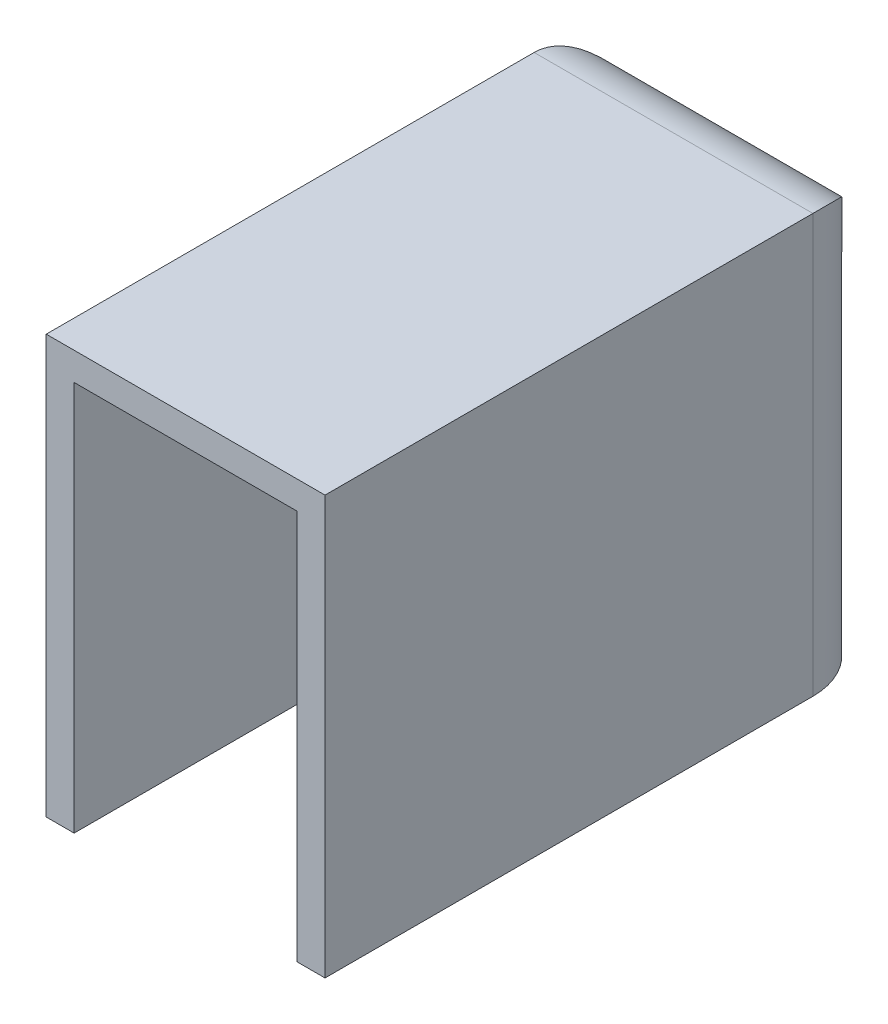
ISO-10303-21;
HEADER;
FILE_DESCRIPTION(('STEP AP214'),'2;1');
FILE_NAME('part.step','',(''),(''),'','','');
FILE_SCHEMA(('AUTOMOTIVE_DESIGN { 1 0 10303 214 1 1 1 1 }'));
ENDSEC;
DATA;
#1=APPLICATION_CONTEXT('core data for automotive mechanical design processes');
#2=APPLICATION_PROTOCOL_DEFINITION('international standard','automotive_design',2000,#1);
#3=PRODUCT_CONTEXT('',#1,'mechanical');
#4=PRODUCT('Part','Part','',(#3));
#5=PRODUCT_RELATED_PRODUCT_CATEGORY('part','',(#4));
#6=PRODUCT_DEFINITION_FORMATION('','',#4);
#7=PRODUCT_DEFINITION_CONTEXT('part definition',#1,'design');
#8=PRODUCT_DEFINITION('design','',#6,#7);
#9=PRODUCT_DEFINITION_SHAPE('','',#8);
#10=(LENGTH_UNIT() NAMED_UNIT(*) SI_UNIT(.MILLI.,.METRE.));
#11=(NAMED_UNIT(*) PLANE_ANGLE_UNIT() SI_UNIT($,.RADIAN.));
#12=(NAMED_UNIT(*) SI_UNIT($,.STERADIAN.) SOLID_ANGLE_UNIT());
#13=UNCERTAINTY_MEASURE_WITH_UNIT(LENGTH_MEASURE(1.E-05),#10,'distance_accuracy_value','');
#14=(GEOMETRIC_REPRESENTATION_CONTEXT(3) GLOBAL_UNCERTAINTY_ASSIGNED_CONTEXT((#13)) GLOBAL_UNIT_ASSIGNED_CONTEXT((#10,
#11,#12)) REPRESENTATION_CONTEXT('',''));
#15=CARTESIAN_POINT('',(0.,0.,0.));
#16=DIRECTION('',(0.,0.,1.));
#17=DIRECTION('',(1.,0.,0.));
#18=AXIS2_PLACEMENT_3D('',#15,#16,#17);
#19=CARTESIAN_POINT('',(0.,0.,2.));
#20=DIRECTION('',(0.,0.,-1.));
#21=DIRECTION('',(-1.,0.,0.));
#22=AXIS2_PLACEMENT_3D('',#19,#20,#21);
#23=PLANE('',#22);
#24=DIRECTION('',(0.,1.,0.));
#25=VECTOR('',#24,1.);
#26=CARTESIAN_POINT('',(8.,0.,2.));
#27=LINE('',#26,#25);
#28=CARTESIAN_POINT('',(8.,-15.,2.));
#29=VERTEX_POINT('',#28);
#30=CARTESIAN_POINT('',(8.,13.,2.));
#31=VERTEX_POINT('',#30);
#32=EDGE_CURVE('E177',#29,#31,#27,.T.);
#33=ORIENTED_EDGE('',*,*,#32,.T.);
#34=DIRECTION('',(-1.,0.,0.));
#35=VECTOR('',#34,1.);
#36=CARTESIAN_POINT('',(0.,13.,2.));
#37=LINE('',#36,#35);
#38=CARTESIAN_POINT('',(-8.,13.,2.));
#39=VERTEX_POINT('',#38);
#40=EDGE_CURVE('E181',#31,#39,#37,.T.);
#41=ORIENTED_EDGE('',*,*,#40,.T.);
#42=DIRECTION('',(0.,-1.,0.));
#43=VECTOR('',#42,1.);
#44=CARTESIAN_POINT('',(-8.,0.,2.));
#45=LINE('',#44,#43);
#46=CARTESIAN_POINT('',(-8.,-15.,2.));
#47=VERTEX_POINT('',#46);
#48=EDGE_CURVE('E190',#39,#47,#45,.T.);
#49=ORIENTED_EDGE('',*,*,#48,.T.);
#50=DIRECTION('',(1.,0.,0.));
#51=VECTOR('',#50,1.);
#52=CARTESIAN_POINT('',(0.,-15.,2.));
#53=LINE('',#52,#51);
#54=EDGE_CURVE('E197',#47,#29,#53,.T.);
#55=ORIENTED_EDGE('',*,*,#54,.T.);
#56=EDGE_LOOP('',(#33,#41,#49,#55));
#57=FACE_BOUND('',#56,.T.);
#58=DIRECTION('',(0.,-1.,0.));
#59=VECTOR('',#58,1.);
#60=CARTESIAN_POINT('',(-6.,-10.,2.));
#61=LINE('',#60,#59);
#62=CARTESIAN_POINT('',(-6.,-10.,2.));
#63=VERTEX_POINT('',#62);
#64=CARTESIAN_POINT('',(-6.,-12.,2.));
#65=VERTEX_POINT('',#64);
#66=EDGE_CURVE('E166',#63,#65,#61,.T.);
#67=ORIENTED_EDGE('',*,*,#66,.F.);
#68=DIRECTION('',(-1.,0.,0.));
#69=VECTOR('',#68,1.);
#70=CARTESIAN_POINT('',(6.,-10.,2.));
#71=LINE('',#70,#69);
#72=CARTESIAN_POINT('',(6.,-10.,2.));
#73=VERTEX_POINT('',#72);
#74=EDGE_CURVE('E163',#73,#63,#71,.T.);
#75=ORIENTED_EDGE('',*,*,#74,.F.);
#76=DIRECTION('',(0.,1.,0.));
#77=VECTOR('',#76,1.);
#78=CARTESIAN_POINT('',(6.,-10.,2.));
#79=LINE('',#78,#77);
#80=CARTESIAN_POINT('',(6.,-12.,2.));
#81=VERTEX_POINT('',#80);
#82=EDGE_CURVE('E64',#81,#73,#79,.T.);
#83=ORIENTED_EDGE('',*,*,#82,.F.);
#84=DIRECTION('',(1.,0.,0.));
#85=VECTOR('',#84,1.);
#86=CARTESIAN_POINT('',(6.,-12.,2.));
#87=LINE('',#86,#85);
#88=EDGE_CURVE('E59',#65,#81,#87,.T.);
#89=ORIENTED_EDGE('',*,*,#88,.F.);
#90=EDGE_LOOP('',(#67,#75,#83,#89));
#91=FACE_BOUND('',#90,.T.);
#92=ADVANCED_FACE('F41',(#57,#91),#23,.F.);
#93=CARTESIAN_POINT('',(0.,0.,40.));
#94=DIRECTION('',(0.,0.,-1.));
#95=DIRECTION('',(-1.,0.,0.));
#96=AXIS2_PLACEMENT_3D('',#93,#94,#95);
#97=PLANE('',#96);
#98=DIRECTION('',(0.,1.,0.));
#99=VECTOR('',#98,1.);
#100=CARTESIAN_POINT('',(8.,0.,40.));
#101=LINE('',#100,#99);
#102=CARTESIAN_POINT('',(8.,-15.,40.));
#103=VERTEX_POINT('',#102);
#104=CARTESIAN_POINT('',(8.,13.,40.));
#105=VERTEX_POINT('',#104);
#106=EDGE_CURVE('E198',#103,#105,#101,.T.);
#107=ORIENTED_EDGE('',*,*,#106,.F.);
#108=DIRECTION('',(1.,0.,0.));
#109=VECTOR('',#108,1.);
#110=CARTESIAN_POINT('',(-10.,-15.,40.));
#111=LINE('',#110,#109);
#112=CARTESIAN_POINT('',(10.,-15.,40.));
#113=VERTEX_POINT('',#112);
#114=EDGE_CURVE('E227',#103,#113,#111,.T.);
#115=ORIENTED_EDGE('',*,*,#114,.T.);
#116=DIRECTION('',(0.,1.,0.));
#117=VECTOR('',#116,1.);
#118=CARTESIAN_POINT('',(10.,-15.,40.));
#119=LINE('',#118,#117);
#120=CARTESIAN_POINT('',(10.,15.,40.));
#121=VERTEX_POINT('',#120);
#122=EDGE_CURVE('E217',#113,#121,#119,.T.);
#123=ORIENTED_EDGE('',*,*,#122,.T.);
#124=DIRECTION('',(-1.,0.,0.));
#125=VECTOR('',#124,1.);
#126=CARTESIAN_POINT('',(-10.,15.,40.));
#127=LINE('',#126,#125);
#128=CARTESIAN_POINT('',(-10.,15.,40.));
#129=VERTEX_POINT('',#128);
#130=EDGE_CURVE('E221',#121,#129,#127,.T.);
#131=ORIENTED_EDGE('',*,*,#130,.T.);
#132=DIRECTION('',(0.,-1.,0.));
#133=VECTOR('',#132,1.);
#134=CARTESIAN_POINT('',(-10.,-15.,40.));
#135=LINE('',#134,#133);
#136=CARTESIAN_POINT('',(-10.,-15.,40.));
#137=VERTEX_POINT('',#136);
#138=EDGE_CURVE('E224',#129,#137,#135,.T.);
#139=ORIENTED_EDGE('',*,*,#138,.T.);
#140=CARTESIAN_POINT('',(-8.,-15.,40.));
#141=VERTEX_POINT('',#140);
#142=EDGE_CURVE('E228',#137,#141,#111,.T.);
#143=ORIENTED_EDGE('',*,*,#142,.T.);
#144=DIRECTION('',(0.,-1.,0.));
#145=VECTOR('',#144,1.);
#146=CARTESIAN_POINT('',(-8.,0.,40.));
#147=LINE('',#146,#145);
#148=CARTESIAN_POINT('',(-8.,13.,40.));
#149=VERTEX_POINT('',#148);
#150=EDGE_CURVE('E205',#149,#141,#147,.T.);
#151=ORIENTED_EDGE('',*,*,#150,.F.);
#152=DIRECTION('',(-1.,0.,0.));
#153=VECTOR('',#152,1.);
#154=CARTESIAN_POINT('',(0.,13.,40.));
#155=LINE('',#154,#153);
#156=EDGE_CURVE('E201',#105,#149,#155,.T.);
#157=ORIENTED_EDGE('',*,*,#156,.F.);
#158=EDGE_LOOP('',(#107,#115,#123,#131,#139,#143,#151,#157));
#159=FACE_BOUND('',#158,.T.);
#160=ADVANCED_FACE('F306',(#159),#97,.F.);
#161=CARTESIAN_POINT('',(10.,-15.,40.));
#162=DIRECTION('',(-1.,0.,0.));
#163=DIRECTION('',(0.,0.,1.));
#164=AXIS2_PLACEMENT_3D('',#161,#162,#163);
#165=PLANE('',#164);
#166=DIRECTION('',(0.,0.,-1.));
#167=VECTOR('',#166,1.);
#168=CARTESIAN_POINT('',(10.,-15.,40.));
#169=LINE('',#168,#167);
#170=CARTESIAN_POINT('',(10.,-15.,5.));
#171=VERTEX_POINT('',#170);
#172=EDGE_CURVE('E232',#113,#171,#169,.T.);
#173=ORIENTED_EDGE('',*,*,#172,.T.);
#174=DIRECTION('',(0.,1.,0.));
#175=VECTOR('',#174,1.);
#176=CARTESIAN_POINT('',(10.,15.,5.));
#177=LINE('',#176,#175);
#178=CARTESIAN_POINT('',(10.,15.,5.));
#179=VERTEX_POINT('',#178);
#180=EDGE_CURVE('E11',#171,#179,#177,.T.);
#181=ORIENTED_EDGE('',*,*,#180,.T.);
#182=DIRECTION('',(0.,0.,-1.));
#183=VECTOR('',#182,1.);
#184=CARTESIAN_POINT('',(10.,15.,40.));
#185=LINE('',#184,#183);
#186=EDGE_CURVE('E247',#121,#179,#185,.T.);
#187=ORIENTED_EDGE('',*,*,#186,.F.);
#188=ORIENTED_EDGE('',*,*,#122,.F.);
#189=EDGE_LOOP('',(#173,#181,#187,#188));
#190=FACE_BOUND('',#189,.T.);
#191=ADVANCED_FACE('F310',(#190),#165,.F.);
#192=CARTESIAN_POINT('',(-10.,15.,40.));
#193=DIRECTION('',(0.,-1.,0.));
#194=DIRECTION('',(0.,0.,-1.));
#195=AXIS2_PLACEMENT_3D('',#192,#193,#194);
#196=PLANE('',#195);
#197=ORIENTED_EDGE('',*,*,#186,.T.);
#198=DIRECTION('',(-1.,0.,0.));
#199=VECTOR('',#198,1.);
#200=CARTESIAN_POINT('',(-10.,15.,5.));
#201=LINE('',#200,#199);
#202=CARTESIAN_POINT('',(-10.,15.,5.));
#203=VERTEX_POINT('',#202);
#204=EDGE_CURVE('E51',#179,#203,#201,.T.);
#205=ORIENTED_EDGE('',*,*,#204,.T.);
#206=DIRECTION('',(0.,0.,-1.));
#207=VECTOR('',#206,1.);
#208=CARTESIAN_POINT('',(-10.,15.,40.));
#209=LINE('',#208,#207);
#210=EDGE_CURVE('E243',#129,#203,#209,.T.);
#211=ORIENTED_EDGE('',*,*,#210,.F.);
#212=ORIENTED_EDGE('',*,*,#130,.F.);
#213=EDGE_LOOP('',(#197,#205,#211,#212));
#214=FACE_BOUND('',#213,.T.);
#215=ADVANCED_FACE('F274',(#214),#196,.F.);
#216=CARTESIAN_POINT('',(-10.,-15.,40.));
#217=DIRECTION('',(1.,0.,0.));
#218=DIRECTION('',(0.,0.,-1.));
#219=AXIS2_PLACEMENT_3D('',#216,#217,#218);
#220=PLANE('',#219);
#221=ORIENTED_EDGE('',*,*,#210,.T.);
#222=DIRECTION('',(0.,-1.,0.));
#223=VECTOR('',#222,1.);
#224=CARTESIAN_POINT('',(-10.,-15.,5.));
#225=LINE('',#224,#223);
#226=CARTESIAN_POINT('',(-10.,-15.,5.));
#227=VERTEX_POINT('',#226);
#228=EDGE_CURVE('E251',#203,#227,#225,.T.);
#229=ORIENTED_EDGE('',*,*,#228,.T.);
#230=DIRECTION('',(0.,0.,-1.));
#231=VECTOR('',#230,1.);
#232=CARTESIAN_POINT('',(-10.,-15.,40.));
#233=LINE('',#232,#231);
#234=EDGE_CURVE('E239',#137,#227,#233,.T.);
#235=ORIENTED_EDGE('',*,*,#234,.F.);
#236=ORIENTED_EDGE('',*,*,#138,.F.);
#237=EDGE_LOOP('',(#221,#229,#235,#236));
#238=FACE_BOUND('',#237,.T.);
#239=ADVANCED_FACE('F282',(#238),#220,.F.);
#240=CARTESIAN_POINT('',(-10.,-15.,40.));
#241=DIRECTION('',(0.,1.,0.));
#242=DIRECTION('',(0.,0.,1.));
#243=AXIS2_PLACEMENT_3D('',#240,#241,#242);
#244=PLANE('',#243);
#245=ORIENTED_EDGE('',*,*,#234,.T.);
#246=CARTESIAN_POINT('',(-5.,-15.,5.));
#247=DIRECTION('',(0.,1.,0.));
#248=DIRECTION('',(0.,0.,1.));
#249=AXIS2_PLACEMENT_3D('',#246,#247,#248);
#250=CIRCLE('',#249,5.);
#251=CARTESIAN_POINT('',(-5.,-15.,0.));
#252=VERTEX_POINT('',#251);
#253=EDGE_CURVE('E258',#227,#252,#250,.F.);
#254=ORIENTED_EDGE('',*,*,#253,.T.);
#255=DIRECTION('',(1.,0.,0.));
#256=VECTOR('',#255,1.);
#257=CARTESIAN_POINT('',(-10.,-15.,0.));
#258=LINE('',#257,#256);
#259=CARTESIAN_POINT('',(5.,-15.,0.));
#260=VERTEX_POINT('',#259);
#261=EDGE_CURVE('E186',#252,#260,#258,.T.);
#262=ORIENTED_EDGE('',*,*,#261,.T.);
#263=CARTESIAN_POINT('',(5.,-15.,5.));
#264=DIRECTION('',(0.,1.,0.));
#265=DIRECTION('',(0.,0.,1.));
#266=AXIS2_PLACEMENT_3D('',#263,#264,#265);
#267=CIRCLE('',#266,5.);
#268=EDGE_CURVE('E255',#260,#171,#267,.F.);
#269=ORIENTED_EDGE('',*,*,#268,.T.);
#270=ORIENTED_EDGE('',*,*,#172,.F.);
#271=ORIENTED_EDGE('',*,*,#114,.F.);
#272=DIRECTION('',(0.,0.,-1.));
#273=VECTOR('',#272,1.);
#274=CARTESIAN_POINT('',(8.,-15.,40.));
#275=LINE('',#274,#273);
#276=EDGE_CURVE('E208',#103,#29,#275,.T.);
#277=ORIENTED_EDGE('',*,*,#276,.T.);
#278=ORIENTED_EDGE('',*,*,#54,.F.);
#279=DIRECTION('',(0.,0.,-1.));
#280=VECTOR('',#279,1.);
#281=CARTESIAN_POINT('',(-8.,-15.,40.));
#282=LINE('',#281,#280);
#283=EDGE_CURVE('E194',#141,#47,#282,.T.);
#284=ORIENTED_EDGE('',*,*,#283,.F.);
#285=ORIENTED_EDGE('',*,*,#142,.F.);
#286=EDGE_LOOP('',(#245,#254,#262,#269,#270,#271,#277,#278,#284,#285));
#287=FACE_BOUND('',#286,.T.);
#288=ADVANCED_FACE('F292',(#287),#244,.F.);
#289=CARTESIAN_POINT('',(0.,0.,0.));
#290=DIRECTION('',(0.,0.,-1.));
#291=DIRECTION('',(-1.,0.,0.));
#292=AXIS2_PLACEMENT_3D('',#289,#290,#291);
#293=PLANE('',#292);
#294=ORIENTED_EDGE('',*,*,#261,.F.);
#295=DIRECTION('',(0.,-1.,0.));
#296=VECTOR('',#295,1.);
#297=CARTESIAN_POINT('',(-5.,15.,0.));
#298=LINE('',#297,#296);
#299=CARTESIAN_POINT('',(-5.,10.,0.));
#300=VERTEX_POINT('',#299);
#301=EDGE_CURVE('E267',#252,#300,#298,.F.);
#302=ORIENTED_EDGE('',*,*,#301,.T.);
#303=DIRECTION('',(-1.,0.,0.));
#304=VECTOR('',#303,1.);
#305=CARTESIAN_POINT('',(10.,10.,0.));
#306=LINE('',#305,#304);
#307=CARTESIAN_POINT('',(5.,10.,0.));
#308=VERTEX_POINT('',#307);
#309=EDGE_CURVE('E264',#300,#308,#306,.F.);
#310=ORIENTED_EDGE('',*,*,#309,.T.);
#311=DIRECTION('',(0.,1.,0.));
#312=VECTOR('',#311,1.);
#313=CARTESIAN_POINT('',(5.,-15.,0.));
#314=LINE('',#313,#312);
#315=EDGE_CURVE('E261',#308,#260,#314,.F.);
#316=ORIENTED_EDGE('',*,*,#315,.T.);
#317=EDGE_LOOP('',(#294,#302,#310,#316));
#318=FACE_BOUND('',#317,.T.);
#319=ADVANCED_FACE('F296',(#318),#293,.T.);
#320=CARTESIAN_POINT('',(8.,-15.,40.));
#321=DIRECTION('',(-1.,0.,0.));
#322=DIRECTION('',(0.,0.,1.));
#323=AXIS2_PLACEMENT_3D('',#320,#321,#322);
#324=PLANE('',#323);
#325=ORIENTED_EDGE('',*,*,#32,.F.);
#326=ORIENTED_EDGE('',*,*,#276,.F.);
#327=ORIENTED_EDGE('',*,*,#106,.T.);
#328=DIRECTION('',(0.,0.,-1.));
#329=VECTOR('',#328,1.);
#330=CARTESIAN_POINT('',(8.,13.,40.));
#331=LINE('',#330,#329);
#332=EDGE_CURVE('E182',#105,#31,#331,.T.);
#333=ORIENTED_EDGE('',*,*,#332,.T.);
#334=EDGE_LOOP('',(#325,#326,#327,#333));
#335=FACE_BOUND('',#334,.T.);
#336=ADVANCED_FACE('F331',(#335),#324,.T.);
#337=CARTESIAN_POINT('',(-10.,13.,40.));
#338=DIRECTION('',(0.,-1.,0.));
#339=DIRECTION('',(0.,0.,-1.));
#340=AXIS2_PLACEMENT_3D('',#337,#338,#339);
#341=PLANE('',#340);
#342=ORIENTED_EDGE('',*,*,#40,.F.);
#343=ORIENTED_EDGE('',*,*,#332,.F.);
#344=ORIENTED_EDGE('',*,*,#156,.T.);
#345=DIRECTION('',(0.,0.,-1.));
#346=VECTOR('',#345,1.);
#347=CARTESIAN_POINT('',(-8.,13.,40.));
#348=LINE('',#347,#346);
#349=EDGE_CURVE('E187',#149,#39,#348,.T.);
#350=ORIENTED_EDGE('',*,*,#349,.T.);
#351=EDGE_LOOP('',(#342,#343,#344,#350));
#352=FACE_BOUND('',#351,.T.);
#353=ADVANCED_FACE('F354',(#352),#341,.T.);
#354=CARTESIAN_POINT('',(-8.,-15.,40.));
#355=DIRECTION('',(1.,0.,0.));
#356=DIRECTION('',(0.,0.,-1.));
#357=AXIS2_PLACEMENT_3D('',#354,#355,#356);
#358=PLANE('',#357);
#359=ORIENTED_EDGE('',*,*,#48,.F.);
#360=ORIENTED_EDGE('',*,*,#349,.F.);
#361=ORIENTED_EDGE('',*,*,#150,.T.);
#362=ORIENTED_EDGE('',*,*,#283,.T.);
#363=EDGE_LOOP('',(#359,#360,#361,#362));
#364=FACE_BOUND('',#363,.T.);
#365=ADVANCED_FACE('F326',(#364),#358,.T.);
#366=CARTESIAN_POINT('',(5.,-15.,5.));
#367=DIRECTION('',(0.,-1.,0.));
#368=DIRECTION('',(0.,0.,-1.));
#369=AXIS2_PLACEMENT_3D('',#366,#367,#368);
#370=CYLINDRICAL_SURFACE('',#369,5.);
#371=ORIENTED_EDGE('',*,*,#268,.F.);
#372=ORIENTED_EDGE('',*,*,#315,.F.);
#373=CARTESIAN_POINT('',(5.,10.,5.));
#374=DIRECTION('',(0.707106781186547,-0.707106781186547,0.));
#375=DIRECTION('',(-0.707106781186547,-0.707106781186547,0.));
#376=AXIS2_PLACEMENT_3D('',#373,#374,#375);
#377=ELLIPSE('',#376,7.07106781186547,5.);
#378=EDGE_CURVE('E45',#179,#308,#377,.F.);
#379=ORIENTED_EDGE('',*,*,#378,.F.);
#380=ORIENTED_EDGE('',*,*,#180,.F.);
#381=EDGE_LOOP('',(#371,#372,#379,#380));
#382=FACE_BOUND('',#381,.T.);
#383=ADVANCED_FACE('F43',(#382),#370,.T.);
#384=CARTESIAN_POINT('',(-10.,10.,5.));
#385=DIRECTION('',(1.,0.,0.));
#386=DIRECTION('',(0.,0.,-1.));
#387=AXIS2_PLACEMENT_3D('',#384,#385,#386);
#388=CYLINDRICAL_SURFACE('',#387,5.);
#389=ORIENTED_EDGE('',*,*,#378,.T.);
#390=ORIENTED_EDGE('',*,*,#309,.F.);
#391=CARTESIAN_POINT('',(-5.,10.,5.));
#392=DIRECTION('',(0.707106781186547,0.707106781186547,0.));
#393=DIRECTION('',(0.707106781186547,-0.707106781186547,0.));
#394=AXIS2_PLACEMENT_3D('',#391,#392,#393);
#395=ELLIPSE('',#394,7.07106781186547,5.);
#396=EDGE_CURVE('E168',#203,#300,#395,.F.);
#397=ORIENTED_EDGE('',*,*,#396,.F.);
#398=ORIENTED_EDGE('',*,*,#204,.F.);
#399=EDGE_LOOP('',(#389,#390,#397,#398));
#400=FACE_BOUND('',#399,.T.);
#401=ADVANCED_FACE('F286',(#400),#388,.T.);
#402=CARTESIAN_POINT('',(-5.,-15.,5.));
#403=DIRECTION('',(0.,1.,0.));
#404=DIRECTION('',(0.,0.,1.));
#405=AXIS2_PLACEMENT_3D('',#402,#403,#404);
#406=CYLINDRICAL_SURFACE('',#405,5.);
#407=ORIENTED_EDGE('',*,*,#396,.T.);
#408=ORIENTED_EDGE('',*,*,#301,.F.);
#409=ORIENTED_EDGE('',*,*,#253,.F.);
#410=ORIENTED_EDGE('',*,*,#228,.F.);
#411=EDGE_LOOP('',(#407,#408,#409,#410));
#412=FACE_BOUND('',#411,.T.);
#413=ADVANCED_FACE('F289',(#412),#406,.T.);
#414=CARTESIAN_POINT('',(-6.,-10.,4.5));
#415=DIRECTION('',(1.,0.,0.));
#416=DIRECTION('',(0.,0.,-1.));
#417=AXIS2_PLACEMENT_3D('',#414,#415,#416);
#418=PLANE('',#417);
#419=ORIENTED_EDGE('',*,*,#66,.T.);
#420=DIRECTION('',(0.,0.,-1.));
#421=VECTOR('',#420,1.);
#422=CARTESIAN_POINT('',(-6.,-12.,4.5));
#423=LINE('',#422,#421);
#424=CARTESIAN_POINT('',(-6.,-12.,4.5));
#425=VERTEX_POINT('',#424);
#426=EDGE_CURVE('E145',#425,#65,#423,.T.);
#427=ORIENTED_EDGE('',*,*,#426,.F.);
#428=DIRECTION('',(0.,-1.,0.));
#429=VECTOR('',#428,1.);
#430=CARTESIAN_POINT('',(-6.,-10.,4.5));
#431=LINE('',#430,#429);
#432=CARTESIAN_POINT('',(-6.,-10.,4.5));
#433=VERTEX_POINT('',#432);
#434=EDGE_CURVE('E153',#433,#425,#431,.T.);
#435=ORIENTED_EDGE('',*,*,#434,.F.);
#436=DIRECTION('',(0.,0.,-1.));
#437=VECTOR('',#436,1.);
#438=CARTESIAN_POINT('',(-6.,-10.,4.5));
#439=LINE('',#438,#437);
#440=EDGE_CURVE('E481',#433,#63,#439,.T.);
#441=ORIENTED_EDGE('',*,*,#440,.T.);
#442=EDGE_LOOP('',(#419,#427,#435,#441));
#443=FACE_BOUND('',#442,.T.);
#444=ADVANCED_FACE('F165',(#443),#418,.F.);
#445=CARTESIAN_POINT('',(6.,-12.,4.5));
#446=DIRECTION('',(0.,1.,0.));
#447=DIRECTION('',(-1.,0.,0.));
#448=AXIS2_PLACEMENT_3D('',#445,#446,#447);
#449=PLANE('',#448);
#450=ORIENTED_EDGE('',*,*,#88,.T.);
#451=DIRECTION('',(0.,0.,-1.));
#452=VECTOR('',#451,1.);
#453=CARTESIAN_POINT('',(6.,-12.,4.5));
#454=LINE('',#453,#452);
#455=CARTESIAN_POINT('',(6.,-12.,4.5));
#456=VERTEX_POINT('',#455);
#457=EDGE_CURVE('E148',#456,#81,#454,.T.);
#458=ORIENTED_EDGE('',*,*,#457,.F.);
#459=DIRECTION('',(1.,0.,0.));
#460=VECTOR('',#459,1.);
#461=CARTESIAN_POINT('',(6.,-12.,4.5));
#462=LINE('',#461,#460);
#463=EDGE_CURVE('E141',#425,#456,#462,.T.);
#464=ORIENTED_EDGE('',*,*,#463,.F.);
#465=ORIENTED_EDGE('',*,*,#426,.T.);
#466=EDGE_LOOP('',(#450,#458,#464,#465));
#467=FACE_BOUND('',#466,.T.);
#468=ADVANCED_FACE('F143',(#467),#449,.F.);
#469=CARTESIAN_POINT('',(6.,-10.,4.5));
#470=DIRECTION('',(-1.,0.,0.));
#471=DIRECTION('',(0.,0.,1.));
#472=AXIS2_PLACEMENT_3D('',#469,#470,#471);
#473=PLANE('',#472);
#474=ORIENTED_EDGE('',*,*,#82,.T.);
#475=DIRECTION('',(0.,0.,-1.));
#476=VECTOR('',#475,1.);
#477=CARTESIAN_POINT('',(6.,-10.,4.5));
#478=LINE('',#477,#476);
#479=CARTESIAN_POINT('',(6.,-10.,4.5));
#480=VERTEX_POINT('',#479);
#481=EDGE_CURVE('E173',#480,#73,#478,.T.);
#482=ORIENTED_EDGE('',*,*,#481,.F.);
#483=DIRECTION('',(0.,1.,0.));
#484=VECTOR('',#483,1.);
#485=CARTESIAN_POINT('',(6.,-10.,4.5));
#486=LINE('',#485,#484);
#487=EDGE_CURVE('E152',#456,#480,#486,.T.);
#488=ORIENTED_EDGE('',*,*,#487,.F.);
#489=ORIENTED_EDGE('',*,*,#457,.T.);
#490=EDGE_LOOP('',(#474,#482,#488,#489));
#491=FACE_BOUND('',#490,.T.);
#492=ADVANCED_FACE('F395',(#491),#473,.F.);
#493=CARTESIAN_POINT('',(6.,-10.,4.5));
#494=DIRECTION('',(0.,-1.,0.));
#495=DIRECTION('',(1.,0.,0.));
#496=AXIS2_PLACEMENT_3D('',#493,#494,#495);
#497=PLANE('',#496);
#498=ORIENTED_EDGE('',*,*,#74,.T.);
#499=ORIENTED_EDGE('',*,*,#440,.F.);
#500=DIRECTION('',(-1.,0.,0.));
#501=VECTOR('',#500,1.);
#502=CARTESIAN_POINT('',(6.,-10.,4.5));
#503=LINE('',#502,#501);
#504=EDGE_CURVE('E158',#480,#433,#503,.T.);
#505=ORIENTED_EDGE('',*,*,#504,.F.);
#506=ORIENTED_EDGE('',*,*,#481,.T.);
#507=EDGE_LOOP('',(#498,#499,#505,#506));
#508=FACE_BOUND('',#507,.T.);
#509=ADVANCED_FACE('F402',(#508),#497,.F.);
#510=CARTESIAN_POINT('',(0.,0.,4.5));
#511=DIRECTION('',(0.,0.,-1.));
#512=DIRECTION('',(-1.,0.,0.));
#513=AXIS2_PLACEMENT_3D('',#510,#511,#512);
#514=PLANE('',#513);
#515=ORIENTED_EDGE('',*,*,#434,.T.);
#516=ORIENTED_EDGE('',*,*,#463,.T.);
#517=ORIENTED_EDGE('',*,*,#487,.T.);
#518=ORIENTED_EDGE('',*,*,#504,.T.);
#519=EDGE_LOOP('',(#515,#516,#517,#518));
#520=FACE_BOUND('',#519,.T.);
#521=ADVANCED_FACE('F156',(#520),#514,.F.);
#522=CLOSED_SHELL('',(#92,#160,#191,#215,#239,#288,#319,#336,#353,#365,#383,#401,#413,#444,#468,
#492,#509,#521));
#523=MANIFOLD_SOLID_BREP('B2',#522);
#524=ADVANCED_BREP_SHAPE_REPRESENTATION('',(#18,#523),#14);
#525=SHAPE_DEFINITION_REPRESENTATION(#9,#524);
ENDSEC;
END-ISO-10303-21;
